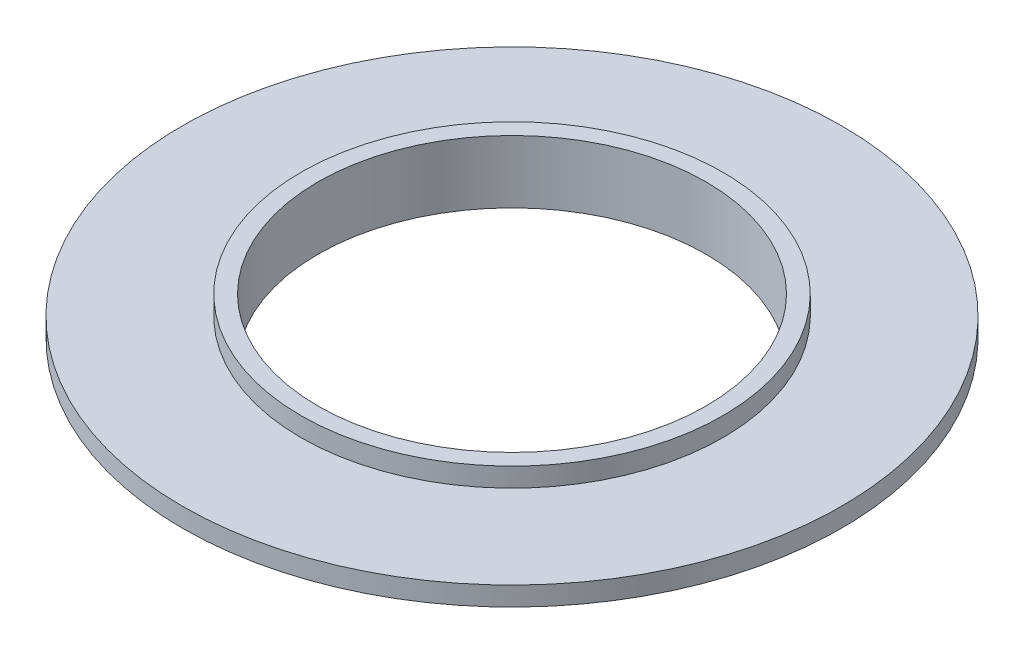
ISO-10303-21;
HEADER;
FILE_DESCRIPTION(('STEP AP214'),'2;1');
FILE_NAME('part.step','',(''),(''),'','','');
FILE_SCHEMA(('AUTOMOTIVE_DESIGN { 1 0 10303 214 1 1 1 1 }'));
ENDSEC;
DATA;
#1=APPLICATION_CONTEXT('core data for automotive mechanical design processes');
#2=APPLICATION_PROTOCOL_DEFINITION('international standard','automotive_design',2000,#1);
#3=PRODUCT_CONTEXT('',#1,'mechanical');
#4=PRODUCT('Part','Part','',(#3));
#5=PRODUCT_RELATED_PRODUCT_CATEGORY('part','',(#4));
#6=PRODUCT_DEFINITION_FORMATION('','',#4);
#7=PRODUCT_DEFINITION_CONTEXT('part definition',#1,'design');
#8=PRODUCT_DEFINITION('design','',#6,#7);
#9=PRODUCT_DEFINITION_SHAPE('','',#8);
#10=(LENGTH_UNIT() NAMED_UNIT(*) SI_UNIT(.MILLI.,.METRE.));
#11=(NAMED_UNIT(*) PLANE_ANGLE_UNIT() SI_UNIT($,.RADIAN.));
#12=(NAMED_UNIT(*) SI_UNIT($,.STERADIAN.) SOLID_ANGLE_UNIT());
#13=UNCERTAINTY_MEASURE_WITH_UNIT(LENGTH_MEASURE(1.E-05),#10,'distance_accuracy_value','');
#14=(GEOMETRIC_REPRESENTATION_CONTEXT(3) GLOBAL_UNCERTAINTY_ASSIGNED_CONTEXT((#13)) GLOBAL_UNIT_ASSIGNED_CONTEXT((#10,
#11,#12)) REPRESENTATION_CONTEXT('',''));
#15=CARTESIAN_POINT('',(0.,0.,0.));
#16=DIRECTION('',(0.,0.,1.));
#17=DIRECTION('',(1.,0.,0.));
#18=AXIS2_PLACEMENT_3D('',#15,#16,#17);
#19=CARTESIAN_POINT('',(0.,-2.,0.));
#20=DIRECTION('',(0.,1.,0.));
#21=DIRECTION('',(0.,0.,1.));
#22=AXIS2_PLACEMENT_3D('',#19,#20,#21);
#23=PLANE('',#22);
#24=CARTESIAN_POINT('',(0.,-2.,0.));
#25=DIRECTION('',(0.,1.,0.));
#26=DIRECTION('',(0.,0.,1.));
#27=AXIS2_PLACEMENT_3D('',#24,#25,#26);
#28=CIRCLE('',#27,60.4483840530269);
#29=CARTESIAN_POINT('',(0.,-2.,60.4483840530269));
#30=VERTEX_POINT('',#29);
#31=EDGE_CURVE('E41',#30,#30,#28,.T.);
#32=ORIENTED_EDGE('',*,*,#31,.F.);
#33=EDGE_LOOP('',(#32));
#34=FACE_BOUND('',#33,.T.);
#35=CARTESIAN_POINT('',(0.,-2.,0.));
#36=DIRECTION('',(0.,1.,0.));
#37=DIRECTION('',(0.,0.,1.));
#38=AXIS2_PLACEMENT_3D('',#35,#36,#37);
#39=CIRCLE('',#38,39.6807256977378);
#40=CARTESIAN_POINT('',(0.,-2.,39.6807256977378));
#41=VERTEX_POINT('',#40);
#42=EDGE_CURVE('E10',#41,#41,#39,.F.);
#43=ORIENTED_EDGE('',*,*,#42,.F.);
#44=EDGE_LOOP('',(#43));
#45=FACE_BOUND('',#44,.T.);
#46=ADVANCED_FACE('F34',(#34,#45),#23,.F.);
#47=CARTESIAN_POINT('',(0.,-2.,0.));
#48=DIRECTION('',(0.,1.,0.));
#49=DIRECTION('',(0.,0.,1.));
#50=AXIS2_PLACEMENT_3D('',#47,#48,#49);
#51=CYLINDRICAL_SURFACE('',#50,60.4483840530269);
#52=ORIENTED_EDGE('',*,*,#31,.T.);
#53=EDGE_LOOP('',(#52));
#54=FACE_BOUND('',#53,.T.);
#55=CARTESIAN_POINT('',(0.,1.5,0.));
#56=DIRECTION('',(0.,1.,0.));
#57=DIRECTION('',(0.,0.,1.));
#58=AXIS2_PLACEMENT_3D('',#55,#56,#57);
#59=CIRCLE('',#58,60.4483840530269);
#60=CARTESIAN_POINT('',(0.,1.5,60.4483840530269));
#61=VERTEX_POINT('',#60);
#62=EDGE_CURVE('E45',#61,#61,#59,.T.);
#63=ORIENTED_EDGE('',*,*,#62,.F.);
#64=EDGE_LOOP('',(#63));
#65=FACE_BOUND('',#64,.T.);
#66=ADVANCED_FACE('F84',(#54,#65),#51,.T.);
#67=CARTESIAN_POINT('',(0.,1.5,0.));
#68=DIRECTION('',(0.,1.,0.));
#69=DIRECTION('',(0.,0.,1.));
#70=AXIS2_PLACEMENT_3D('',#67,#68,#69);
#71=PLANE('',#70);
#72=CARTESIAN_POINT('',(0.,1.5,0.));
#73=DIRECTION('',(0.,1.,0.));
#74=DIRECTION('',(0.,0.,1.));
#75=AXIS2_PLACEMENT_3D('',#72,#73,#74);
#76=CIRCLE('',#75,38.6853186440058);
#77=CARTESIAN_POINT('',(0.,1.5,38.6853186440058));
#78=VERTEX_POINT('',#77);
#79=EDGE_CURVE('E52',#78,#78,#76,.T.);
#80=ORIENTED_EDGE('',*,*,#79,.F.);
#81=EDGE_LOOP('',(#80));
#82=FACE_BOUND('',#81,.T.);
#83=ORIENTED_EDGE('',*,*,#62,.T.);
#84=EDGE_LOOP('',(#83));
#85=FACE_BOUND('',#84,.T.);
#86=ADVANCED_FACE('F36',(#82,#85),#71,.T.);
#87=CARTESIAN_POINT('',(0.,5.,0.));
#88=DIRECTION('',(0.,1.,0.));
#89=DIRECTION('',(0.,0.,1.));
#90=AXIS2_PLACEMENT_3D('',#87,#88,#89);
#91=PLANE('',#90);
#92=CARTESIAN_POINT('',(0.,5.,0.));
#93=DIRECTION('',(0.,1.,0.));
#94=DIRECTION('',(0.,0.,1.));
#95=AXIS2_PLACEMENT_3D('',#92,#93,#94);
#96=CIRCLE('',#95,38.6853186440058);
#97=CARTESIAN_POINT('',(0.,5.,38.6853186440058));
#98=VERTEX_POINT('',#97);
#99=EDGE_CURVE('E50',#98,#98,#96,.T.);
#100=ORIENTED_EDGE('',*,*,#99,.T.);
#101=EDGE_LOOP('',(#100));
#102=FACE_BOUND('',#101,.T.);
#103=CARTESIAN_POINT('',(0.,5.,0.));
#104=DIRECTION('',(0.,1.,0.));
#105=DIRECTION('',(0.,0.,1.));
#106=AXIS2_PLACEMENT_3D('',#103,#104,#105);
#107=CIRCLE('',#106,35.6046844050469);
#108=CARTESIAN_POINT('',(0.,5.,35.6046844050469));
#109=VERTEX_POINT('',#108);
#110=EDGE_CURVE('E55',#109,#109,#107,.T.);
#111=ORIENTED_EDGE('',*,*,#110,.F.);
#112=EDGE_LOOP('',(#111));
#113=FACE_BOUND('',#112,.T.);
#114=ADVANCED_FACE('F94',(#102,#113),#91,.T.);
#115=CARTESIAN_POINT('',(0.,5.,0.));
#116=DIRECTION('',(0.,-1.,0.));
#117=DIRECTION('',(0.,0.,-1.));
#118=AXIS2_PLACEMENT_3D('',#115,#116,#117);
#119=CYLINDRICAL_SURFACE('',#118,38.6853186440058);
#120=ORIENTED_EDGE('',*,*,#99,.F.);
#121=EDGE_LOOP('',(#120));
#122=FACE_BOUND('',#121,.T.);
#123=ORIENTED_EDGE('',*,*,#79,.T.);
#124=EDGE_LOOP('',(#123));
#125=FACE_BOUND('',#124,.T.);
#126=ADVANCED_FACE('F80',(#122,#125),#119,.T.);
#127=CARTESIAN_POINT('',(0.,5.,0.));
#128=DIRECTION('',(0.,-1.,0.));
#129=DIRECTION('',(0.,0.,-1.));
#130=AXIS2_PLACEMENT_3D('',#127,#128,#129);
#131=CYLINDRICAL_SURFACE('',#130,35.6046844050469);
#132=ORIENTED_EDGE('',*,*,#110,.T.);
#133=EDGE_LOOP('',(#132));
#134=FACE_BOUND('',#133,.T.);
#135=CARTESIAN_POINT('',(0.,-6.5,0.));
#136=DIRECTION('',(0.,-1.,0.));
#137=DIRECTION('',(0.,0.,-1.));
#138=AXIS2_PLACEMENT_3D('',#135,#136,#137);
#139=CIRCLE('',#138,35.6046844050469);
#140=CARTESIAN_POINT('',(0.,-6.5,-35.6046844050469));
#141=VERTEX_POINT('',#140);
#142=EDGE_CURVE('E63',#141,#141,#139,.T.);
#143=ORIENTED_EDGE('',*,*,#142,.T.);
#144=EDGE_LOOP('',(#143));
#145=FACE_BOUND('',#144,.T.);
#146=ADVANCED_FACE('F67',(#134,#145),#131,.F.);
#147=CARTESIAN_POINT('',(0.,-6.5,0.));
#148=DIRECTION('',(0.,-1.,0.));
#149=DIRECTION('',(0.,0.,-1.));
#150=AXIS2_PLACEMENT_3D('',#147,#148,#149);
#151=PLANE('',#150);
#152=CARTESIAN_POINT('',(0.,-6.5,0.));
#153=DIRECTION('',(0.,-1.,0.));
#154=DIRECTION('',(0.,0.,-1.));
#155=AXIS2_PLACEMENT_3D('',#152,#153,#154);
#156=CIRCLE('',#155,39.6807256977378);
#157=CARTESIAN_POINT('',(0.,-6.5,-39.6807256977378));
#158=VERTEX_POINT('',#157);
#159=EDGE_CURVE('E60',#158,#158,#156,.T.);
#160=ORIENTED_EDGE('',*,*,#159,.T.);
#161=EDGE_LOOP('',(#160));
#162=FACE_BOUND('',#161,.T.);
#163=ORIENTED_EDGE('',*,*,#142,.F.);
#164=EDGE_LOOP('',(#163));
#165=FACE_BOUND('',#164,.T.);
#166=ADVANCED_FACE('F69',(#162,#165),#151,.T.);
#167=CARTESIAN_POINT('',(0.,-6.5,0.));
#168=DIRECTION('',(0.,1.,0.));
#169=DIRECTION('',(0.,0.,1.));
#170=AXIS2_PLACEMENT_3D('',#167,#168,#169);
#171=CYLINDRICAL_SURFACE('',#170,39.6807256977378);
#172=ORIENTED_EDGE('',*,*,#159,.F.);
#173=EDGE_LOOP('',(#172));
#174=FACE_BOUND('',#173,.T.);
#175=ORIENTED_EDGE('',*,*,#42,.T.);
#176=EDGE_LOOP('',(#175));
#177=FACE_BOUND('',#176,.T.);
#178=ADVANCED_FACE('F71',(#174,#177),#171,.T.);
#179=CLOSED_SHELL('',(#46,#66,#86,#114,#126,#146,#166,#178));
#180=MANIFOLD_SOLID_BREP('B2',#179);
#181=ADVANCED_BREP_SHAPE_REPRESENTATION('',(#18,#180),#14);
#182=SHAPE_DEFINITION_REPRESENTATION(#9,#181);
ENDSEC;
END-ISO-10303-21;
